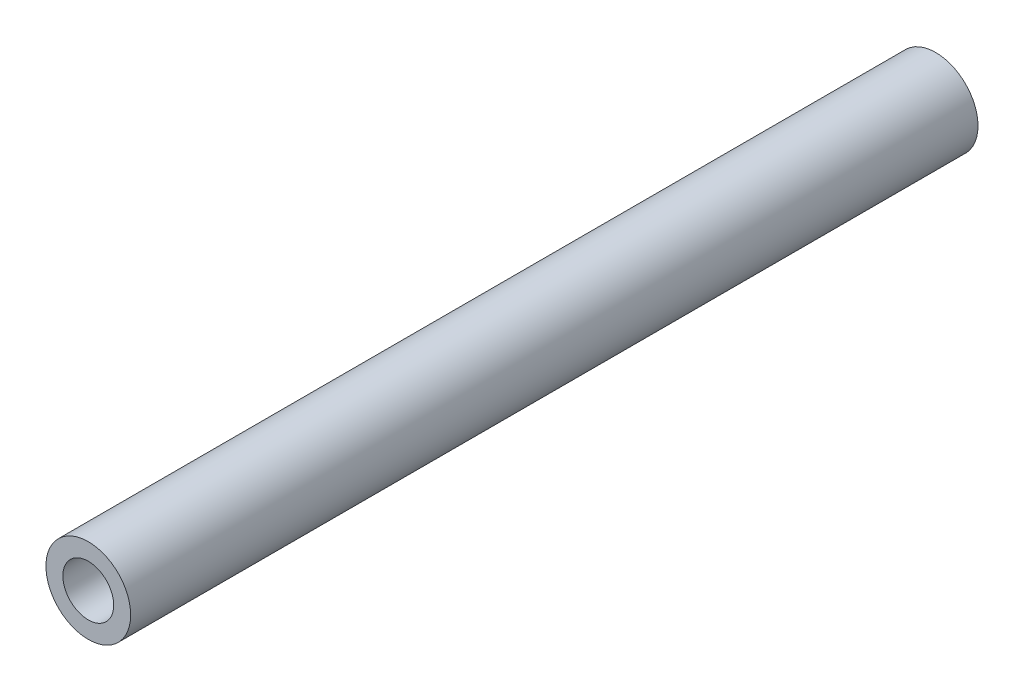
ISO-10303-21;
HEADER;
FILE_DESCRIPTION(('STEP AP214'),'2;1');
FILE_NAME('part.step','',(''),(''),'','','');
FILE_SCHEMA(('AUTOMOTIVE_DESIGN { 1 0 10303 214 1 1 1 1 }'));
ENDSEC;
DATA;
#1=APPLICATION_CONTEXT('core data for automotive mechanical design processes');
#2=APPLICATION_PROTOCOL_DEFINITION('international standard','automotive_design',2000,#1);
#3=PRODUCT_CONTEXT('',#1,'mechanical');
#4=PRODUCT('Part','Part','',(#3));
#5=PRODUCT_RELATED_PRODUCT_CATEGORY('part','',(#4));
#6=PRODUCT_DEFINITION_FORMATION('','',#4);
#7=PRODUCT_DEFINITION_CONTEXT('part definition',#1,'design');
#8=PRODUCT_DEFINITION('design','',#6,#7);
#9=PRODUCT_DEFINITION_SHAPE('','',#8);
#10=(LENGTH_UNIT() NAMED_UNIT(*) SI_UNIT(.MILLI.,.METRE.));
#11=(NAMED_UNIT(*) PLANE_ANGLE_UNIT() SI_UNIT($,.RADIAN.));
#12=(NAMED_UNIT(*) SI_UNIT($,.STERADIAN.) SOLID_ANGLE_UNIT());
#13=UNCERTAINTY_MEASURE_WITH_UNIT(LENGTH_MEASURE(1.E-05),#10,'distance_accuracy_value','');
#14=(GEOMETRIC_REPRESENTATION_CONTEXT(3) GLOBAL_UNCERTAINTY_ASSIGNED_CONTEXT((#13)) GLOBAL_UNIT_ASSIGNED_CONTEXT((#10,
#11,#12)) REPRESENTATION_CONTEXT('',''));
#15=CARTESIAN_POINT('',(0.,0.,0.));
#16=DIRECTION('',(0.,0.,1.));
#17=DIRECTION('',(1.,0.,0.));
#18=AXIS2_PLACEMENT_3D('',#15,#16,#17);
#19=CARTESIAN_POINT('',(0.,0.,5000.));
#20=DIRECTION('',(0.,0.,1.));
#21=DIRECTION('',(1.,0.,0.));
#22=AXIS2_PLACEMENT_3D('',#19,#20,#21);
#23=PLANE('',#22);
#24=CARTESIAN_POINT('',(0.,0.,5000.));
#25=DIRECTION('',(0.,0.,1.));
#26=DIRECTION('',(1.,0.,0.));
#27=AXIS2_PLACEMENT_3D('',#24,#25,#26);
#28=CIRCLE('',#27,250.);
#29=CARTESIAN_POINT('',(250.,0.,5000.));
#30=VERTEX_POINT('',#29);
#31=EDGE_CURVE('E10',#30,#30,#28,.T.);
#32=ORIENTED_EDGE('',*,*,#31,.T.);
#33=EDGE_LOOP('',(#32));
#34=FACE_BOUND('',#33,.T.);
#35=CARTESIAN_POINT('',(0.,0.,5000.));
#36=DIRECTION('',(0.,0.,1.));
#37=DIRECTION('',(1.,0.,0.));
#38=AXIS2_PLACEMENT_3D('',#35,#36,#37);
#39=CIRCLE('',#38,150.);
#40=CARTESIAN_POINT('',(150.,0.,5000.));
#41=VERTEX_POINT('',#40);
#42=EDGE_CURVE('E45',#41,#41,#39,.T.);
#43=ORIENTED_EDGE('',*,*,#42,.F.);
#44=EDGE_LOOP('',(#43));
#45=FACE_BOUND('',#44,.T.);
#46=ADVANCED_FACE('F34',(#34,#45),#23,.T.);
#47=CARTESIAN_POINT('',(0.,0.,0.));
#48=DIRECTION('',(0.,0.,1.));
#49=DIRECTION('',(1.,0.,0.));
#50=AXIS2_PLACEMENT_3D('',#47,#48,#49);
#51=PLANE('',#50);
#52=CARTESIAN_POINT('',(0.,0.,0.));
#53=DIRECTION('',(0.,0.,1.));
#54=DIRECTION('',(1.,0.,0.));
#55=AXIS2_PLACEMENT_3D('',#52,#53,#54);
#56=CIRCLE('',#55,250.);
#57=CARTESIAN_POINT('',(250.,0.,0.));
#58=VERTEX_POINT('',#57);
#59=EDGE_CURVE('E38',#58,#58,#56,.T.);
#60=ORIENTED_EDGE('',*,*,#59,.F.);
#61=EDGE_LOOP('',(#60));
#62=FACE_BOUND('',#61,.T.);
#63=CARTESIAN_POINT('',(0.,0.,0.));
#64=DIRECTION('',(0.,0.,1.));
#65=DIRECTION('',(1.,0.,0.));
#66=AXIS2_PLACEMENT_3D('',#63,#64,#65);
#67=CIRCLE('',#66,150.);
#68=CARTESIAN_POINT('',(150.,0.,0.));
#69=VERTEX_POINT('',#68);
#70=EDGE_CURVE('E47',#69,#69,#67,.T.);
#71=ORIENTED_EDGE('',*,*,#70,.T.);
#72=EDGE_LOOP('',(#71));
#73=FACE_BOUND('',#72,.T.);
#74=ADVANCED_FACE('F57',(#62,#73),#51,.F.);
#75=CARTESIAN_POINT('',(0.,0.,5000.));
#76=DIRECTION('',(0.,0.,-1.));
#77=DIRECTION('',(-1.,0.,0.));
#78=AXIS2_PLACEMENT_3D('',#75,#76,#77);
#79=CYLINDRICAL_SURFACE('',#78,250.);
#80=ORIENTED_EDGE('',*,*,#31,.F.);
#81=EDGE_LOOP('',(#80));
#82=FACE_BOUND('',#81,.T.);
#83=ORIENTED_EDGE('',*,*,#59,.T.);
#84=EDGE_LOOP('',(#83));
#85=FACE_BOUND('',#84,.T.);
#86=ADVANCED_FACE('F36',(#82,#85),#79,.T.);
#87=CARTESIAN_POINT('',(0.,0.,5000.));
#88=DIRECTION('',(0.,0.,-1.));
#89=DIRECTION('',(-1.,0.,0.));
#90=AXIS2_PLACEMENT_3D('',#87,#88,#89);
#91=CYLINDRICAL_SURFACE('',#90,150.);
#92=ORIENTED_EDGE('',*,*,#42,.T.);
#93=EDGE_LOOP('',(#92));
#94=FACE_BOUND('',#93,.T.);
#95=ORIENTED_EDGE('',*,*,#70,.F.);
#96=EDGE_LOOP('',(#95));
#97=FACE_BOUND('',#96,.T.);
#98=ADVANCED_FACE('F53',(#94,#97),#91,.F.);
#99=CLOSED_SHELL('',(#46,#74,#86,#98));
#100=MANIFOLD_SOLID_BREP('B2',#99);
#101=ADVANCED_BREP_SHAPE_REPRESENTATION('',(#18,#100),#14);
#102=SHAPE_DEFINITION_REPRESENTATION(#9,#101);
ENDSEC;
END-ISO-10303-21;
